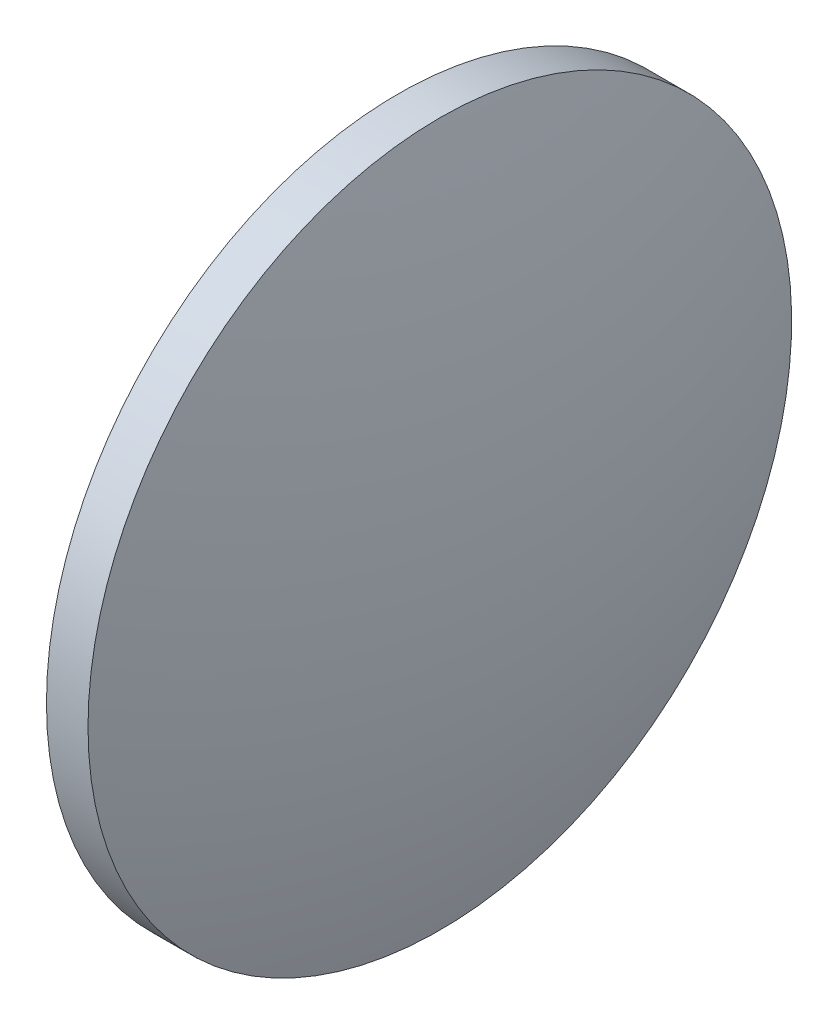
ISO-10303-21;
HEADER;
FILE_DESCRIPTION(('STEP AP214'),'2;1');
FILE_NAME('part.step','',(''),(''),'','','');
FILE_SCHEMA(('AUTOMOTIVE_DESIGN { 1 0 10303 214 1 1 1 1 }'));
ENDSEC;
DATA;
#1=APPLICATION_CONTEXT('core data for automotive mechanical design processes');
#2=APPLICATION_PROTOCOL_DEFINITION('international standard','automotive_design',2000,#1);
#3=PRODUCT_CONTEXT('',#1,'mechanical');
#4=PRODUCT('Part','Part','',(#3));
#5=PRODUCT_RELATED_PRODUCT_CATEGORY('part','',(#4));
#6=PRODUCT_DEFINITION_FORMATION('','',#4);
#7=PRODUCT_DEFINITION_CONTEXT('part definition',#1,'design');
#8=PRODUCT_DEFINITION('design','',#6,#7);
#9=PRODUCT_DEFINITION_SHAPE('','',#8);
#10=(LENGTH_UNIT() NAMED_UNIT(*) SI_UNIT(.MILLI.,.METRE.));
#11=(NAMED_UNIT(*) PLANE_ANGLE_UNIT() SI_UNIT($,.RADIAN.));
#12=(NAMED_UNIT(*) SI_UNIT($,.STERADIAN.) SOLID_ANGLE_UNIT());
#13=UNCERTAINTY_MEASURE_WITH_UNIT(LENGTH_MEASURE(1.E-05),#10,'distance_accuracy_value','');
#14=(GEOMETRIC_REPRESENTATION_CONTEXT(3) GLOBAL_UNCERTAINTY_ASSIGNED_CONTEXT((#13)) GLOBAL_UNIT_ASSIGNED_CONTEXT((#10,
#11,#12)) REPRESENTATION_CONTEXT('',''));
#15=CARTESIAN_POINT('',(0.,0.,0.));
#16=DIRECTION('',(0.,0.,1.));
#17=DIRECTION('',(1.,0.,0.));
#18=AXIS2_PLACEMENT_3D('',#15,#16,#17);
#19=CARTESIAN_POINT('',(455.643043550886,103.517771116833,0.));
#20=DIRECTION('',(-1.,0.,0.));
#21=DIRECTION('',(0.,1.,0.));
#22=AXIS2_PLACEMENT_3D('',#19,#20,#21);
#23=SPHERICAL_SURFACE('',#22,91.4055555555556);
#24=CARTESIAN_POINT('',(543.448599106442,103.517771116833,0.));
#25=DIRECTION('',(-1.,0.,0.));
#26=DIRECTION('',(0.,0.,1.));
#27=AXIS2_PLACEMENT_3D('',#24,#25,#26);
#28=CIRCLE('',#27,25.4);
#29=CARTESIAN_POINT('',(543.448599106442,103.517771116833,25.4));
#30=VERTEX_POINT('',#29);
#31=EDGE_CURVE('E10',#30,#30,#28,.T.);
#32=ORIENTED_EDGE('',*,*,#31,.F.);
#33=EDGE_LOOP('',(#32));
#34=FACE_BOUND('',#33,.T.);
#35=ADVANCED_FACE('F35',(#34),#23,.T.);
#36=CARTESIAN_POINT('',(528.758525484176,103.517771116833,0.));
#37=DIRECTION('',(-1.,0.,0.));
#38=DIRECTION('',(0.,0.,1.));
#39=AXIS2_PLACEMENT_3D('',#36,#37,#38);
#40=CYLINDRICAL_SURFACE('',#39,25.4);
#41=CARTESIAN_POINT('',(540.448599106442,103.517771116833,0.));
#42=DIRECTION('',(-1.,0.,0.));
#43=DIRECTION('',(0.,0.,1.));
#44=AXIS2_PLACEMENT_3D('',#41,#42,#43);
#45=CIRCLE('',#44,25.4);
#46=CARTESIAN_POINT('',(540.448599106442,103.517771116833,25.4));
#47=VERTEX_POINT('',#46);
#48=EDGE_CURVE('E41',#47,#47,#45,.T.);
#49=ORIENTED_EDGE('',*,*,#48,.F.);
#50=EDGE_LOOP('',(#49));
#51=FACE_BOUND('',#50,.T.);
#52=ORIENTED_EDGE('',*,*,#31,.T.);
#53=EDGE_LOOP('',(#52));
#54=FACE_BOUND('',#53,.T.);
#55=ADVANCED_FACE('F49',(#51,#54),#40,.T.);
#56=CARTESIAN_POINT('',(540.448599106442,103.517771116833,0.));
#57=DIRECTION('',(1.,0.,0.));
#58=DIRECTION('',(0.,0.,-1.));
#59=AXIS2_PLACEMENT_3D('',#56,#57,#58);
#60=PLANE('',#59);
#61=ORIENTED_EDGE('',*,*,#48,.T.);
#62=EDGE_LOOP('',(#61));
#63=FACE_BOUND('',#62,.T.);
#64=ADVANCED_FACE('F47',(#63),#60,.F.);
#65=CLOSED_SHELL('',(#35,#55,#64));
#66=MANIFOLD_SOLID_BREP('B2',#65);
#67=ADVANCED_BREP_SHAPE_REPRESENTATION('',(#18,#66),#14);
#68=SHAPE_DEFINITION_REPRESENTATION(#9,#67);
ENDSEC;
END-ISO-10303-21;
